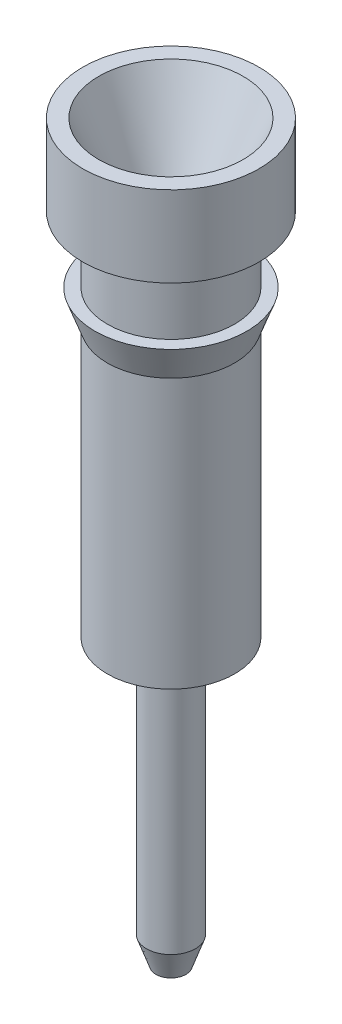
ISO-10303-21;
HEADER;
FILE_DESCRIPTION(('STEP AP214'),'2;1');
FILE_NAME('part.step','',(''),(''),'','','');
FILE_SCHEMA(('AUTOMOTIVE_DESIGN { 1 0 10303 214 1 1 1 1 }'));
ENDSEC;
DATA;
#1=APPLICATION_CONTEXT('core data for automotive mechanical design processes');
#2=APPLICATION_PROTOCOL_DEFINITION('international standard','automotive_design',2000,#1);
#3=PRODUCT_CONTEXT('',#1,'mechanical');
#4=PRODUCT('Part','Part','',(#3));
#5=PRODUCT_RELATED_PRODUCT_CATEGORY('part','',(#4));
#6=PRODUCT_DEFINITION_FORMATION('','',#4);
#7=PRODUCT_DEFINITION_CONTEXT('part definition',#1,'design');
#8=PRODUCT_DEFINITION('design','',#6,#7);
#9=PRODUCT_DEFINITION_SHAPE('','',#8);
#10=(LENGTH_UNIT() NAMED_UNIT(*) SI_UNIT(.MILLI.,.METRE.));
#11=(NAMED_UNIT(*) PLANE_ANGLE_UNIT() SI_UNIT($,.RADIAN.));
#12=(NAMED_UNIT(*) SI_UNIT($,.STERADIAN.) SOLID_ANGLE_UNIT());
#13=UNCERTAINTY_MEASURE_WITH_UNIT(LENGTH_MEASURE(1.E-05),#10,'distance_accuracy_value','');
#14=(GEOMETRIC_REPRESENTATION_CONTEXT(3) GLOBAL_UNCERTAINTY_ASSIGNED_CONTEXT((#13)) GLOBAL_UNIT_ASSIGNED_CONTEXT((#10,
#11,#12)) REPRESENTATION_CONTEXT('',''));
#15=CARTESIAN_POINT('',(0.,0.,0.));
#16=DIRECTION('',(0.,0.,1.));
#17=DIRECTION('',(1.,0.,0.));
#18=AXIS2_PLACEMENT_3D('',#15,#16,#17);
#19=CARTESIAN_POINT('',(0.,-6.07059999992998,0.));
#20=DIRECTION('',(0.,1.,0.));
#21=DIRECTION('',(0.,0.,1.));
#22=AXIS2_PLACEMENT_3D('',#19,#20,#21);
#23=CONICAL_SURFACE('',#22,0.152400000047237,0.785398163210954);
#24=CARTESIAN_POINT('',(0.,-6.22300000003406,0.));
#25=VERTEX_POINT('',#24);
#26=VERTEX_LOOP('',#25);
#27=FACE_BOUND('',#26,.T.);
#28=CARTESIAN_POINT('',(0.,-6.0706,0.));
#29=DIRECTION('',(0.,1.,0.));
#30=DIRECTION('',(-1.,0.,0.));
#31=AXIS2_PLACEMENT_3D('',#28,#29,#30);
#32=CIRCLE('',#31,0.1524);
#33=CARTESIAN_POINT('',(-0.1524,-6.0706,0.));
#34=VERTEX_POINT('',#33);
#35=EDGE_CURVE('E33',#34,#34,#32,.T.);
#36=ORIENTED_EDGE('',*,*,#35,.T.);
#37=EDGE_LOOP('',(#36));
#38=FACE_BOUND('',#37,.T.);
#39=ADVANCED_FACE('F17',(#27,#38),#23,.F.);
#40=CARTESIAN_POINT('',(0.,-6.223,0.));
#41=DIRECTION('',(0.,1.,0.));
#42=DIRECTION('',(-1.,0.,0.));
#43=AXIS2_PLACEMENT_3D('',#40,#41,#42);
#44=CYLINDRICAL_SURFACE('',#43,0.1524);
#45=CARTESIAN_POINT('',(0.,-4.77519999998322,0.));
#46=DIRECTION('',(0.,1.,0.));
#47=DIRECTION('',(-1.,0.,0.));
#48=AXIS2_PLACEMENT_3D('',#45,#46,#47);
#49=CIRCLE('',#48,0.152400000004604);
#50=CARTESIAN_POINT('',(-0.152400000004604,-4.77519999998322,0.));
#51=VERTEX_POINT('',#50);
#52=EDGE_CURVE('E35',#51,#51,#49,.T.);
#53=ORIENTED_EDGE('',*,*,#52,.T.);
#54=EDGE_LOOP('',(#53));
#55=FACE_BOUND('',#54,.T.);
#56=ORIENTED_EDGE('',*,*,#35,.F.);
#57=EDGE_LOOP('',(#56));
#58=FACE_BOUND('',#57,.T.);
#59=ADVANCED_FACE('F30',(#55,#58),#44,.F.);
#60=CARTESIAN_POINT('',(0.,-1.37769600013371,0.));
#61=DIRECTION('',(0.,1.,0.));
#62=DIRECTION('',(0.,0.,1.));
#63=AXIS2_PLACEMENT_3D('',#60,#61,#62);
#64=CONICAL_SURFACE('',#63,0.375919999996199,0.0656948015527935);
#65=CARTESIAN_POINT('',(0.,-1.377696,0.));
#66=DIRECTION('',(0.,1.,0.));
#67=DIRECTION('',(-1.,0.,0.));
#68=AXIS2_PLACEMENT_3D('',#65,#66,#67);
#69=CIRCLE('',#68,0.37592);
#70=CARTESIAN_POINT('',(-0.37592,-1.377696,0.));
#71=VERTEX_POINT('',#70);
#72=EDGE_CURVE('E38',#71,#71,#69,.T.);
#73=ORIENTED_EDGE('',*,*,#72,.T.);
#74=EDGE_LOOP('',(#73));
#75=FACE_BOUND('',#74,.T.);
#76=ORIENTED_EDGE('',*,*,#52,.F.);
#77=EDGE_LOOP('',(#76));
#78=FACE_BOUND('',#77,.T.);
#79=ADVANCED_FACE('F245',(#75,#78),#64,.F.);
#80=CARTESIAN_POINT('',(0.,-6.223,0.));
#81=DIRECTION('',(0.,1.,0.));
#82=DIRECTION('',(-1.,0.,0.));
#83=AXIS2_PLACEMENT_3D('',#80,#81,#82);
#84=CYLINDRICAL_SURFACE('',#83,0.37592);
#85=CARTESIAN_POINT('',(0.,-0.711200000012013,0.));
#86=DIRECTION('',(0.,1.,0.));
#87=DIRECTION('',(-1.,0.,0.));
#88=AXIS2_PLACEMENT_3D('',#85,#86,#87);
#89=CIRCLE('',#88,0.375919999981988);
#90=CARTESIAN_POINT('',(-0.375919999981988,-0.711200000012013,0.));
#91=VERTEX_POINT('',#90);
#92=EDGE_CURVE('E66',#91,#91,#89,.T.);
#93=ORIENTED_EDGE('',*,*,#92,.T.);
#94=EDGE_LOOP('',(#93));
#95=FACE_BOUND('',#94,.T.);
#96=ORIENTED_EDGE('',*,*,#72,.F.);
#97=EDGE_LOOP('',(#96));
#98=FACE_BOUND('',#97,.T.);
#99=ADVANCED_FACE('F206',(#95,#98),#84,.F.);
#100=CARTESIAN_POINT('',(0.,0.127000000020416,0.));
#101=DIRECTION('',(0.,1.,0.));
#102=DIRECTION('',(0.,0.,1.));
#103=AXIS2_PLACEMENT_3D('',#100,#101,#102);
#104=CONICAL_SURFACE('',#103,0.749299999995401,0.419067499698792);
#105=CARTESIAN_POINT('',(0.,0.127000000020416,0.));
#106=DIRECTION('',(0.,1.,0.));
#107=DIRECTION('',(0.,0.,1.));
#108=AXIS2_PLACEMENT_3D('',#105,#106,#107);
#109=CIRCLE('',#108,0.749299999995401);
#110=CARTESIAN_POINT('',(0.,0.127000000020416,0.749299999995401));
#111=VERTEX_POINT('',#110);
#112=EDGE_CURVE('E20',#111,#111,#109,.T.);
#113=ORIENTED_EDGE('',*,*,#112,.T.);
#114=EDGE_LOOP('',(#113));
#115=FACE_BOUND('',#114,.T.);
#116=ORIENTED_EDGE('',*,*,#92,.F.);
#117=EDGE_LOOP('',(#116));
#118=FACE_BOUND('',#117,.T.);
#119=ADVANCED_FACE('F202',(#115,#118),#104,.F.);
#120=CARTESIAN_POINT('',(0.,0.127,0.));
#121=DIRECTION('',(0.,-1.,0.));
#122=DIRECTION('',(0.,0.,-1.));
#123=AXIS2_PLACEMENT_3D('',#120,#121,#122);
#124=PLANE('',#123);
#125=ORIENTED_EDGE('',*,*,#112,.F.);
#126=EDGE_LOOP('',(#125));
#127=FACE_BOUND('',#126,.T.);
#128=CARTESIAN_POINT('',(0.,0.127,0.));
#129=DIRECTION('',(0.,1.,0.));
#130=DIRECTION('',(0.,0.,1.));
#131=AXIS2_PLACEMENT_3D('',#128,#129,#130);
#132=CIRCLE('',#131,0.9144);
#133=CARTESIAN_POINT('',(0.,0.127,0.9144));
#134=VERTEX_POINT('',#133);
#135=EDGE_CURVE('E61',#134,#134,#132,.F.);
#136=ORIENTED_EDGE('',*,*,#135,.F.);
#137=EDGE_LOOP('',(#136));
#138=FACE_BOUND('',#137,.T.);
#139=ADVANCED_FACE('F130',(#127,#138),#124,.F.);
#140=CARTESIAN_POINT('',(0.,-7.493,0.));
#141=DIRECTION('',(0.,1.,0.));
#142=DIRECTION('',(0.,0.,1.));
#143=AXIS2_PLACEMENT_3D('',#140,#141,#142);
#144=CYLINDRICAL_SURFACE('',#143,0.9144);
#145=ORIENTED_EDGE('',*,*,#135,.T.);
#146=EDGE_LOOP('',(#145));
#147=FACE_BOUND('',#146,.T.);
#148=CARTESIAN_POINT('',(0.,-0.711199999999998,0.));
#149=DIRECTION('',(0.,1.,0.));
#150=DIRECTION('',(0.,0.,1.));
#151=AXIS2_PLACEMENT_3D('',#148,#149,#150);
#152=CIRCLE('',#151,0.9144);
#153=CARTESIAN_POINT('',(0.,-0.711199999999998,0.9144));
#154=VERTEX_POINT('',#153);
#155=EDGE_CURVE('E59',#154,#154,#152,.T.);
#156=ORIENTED_EDGE('',*,*,#155,.T.);
#157=EDGE_LOOP('',(#156));
#158=FACE_BOUND('',#157,.T.);
#159=ADVANCED_FACE('F121',(#147,#158),#144,.T.);
#160=CARTESIAN_POINT('',(0.15621,-7.493,0.));
#161=DIRECTION('',(0.,1.,0.));
#162=DIRECTION('',(0.,0.,1.));
#163=AXIS2_PLACEMENT_3D('',#160,#161,#162);
#164=PLANE('',#163);
#165=CARTESIAN_POINT('',(0.,-7.49300000001085,0.));
#166=DIRECTION('',(0.,1.,0.));
#167=DIRECTION('',(0.,0.,1.));
#168=AXIS2_PLACEMENT_3D('',#165,#166,#167);
#169=CIRCLE('',#168,0.15621000001147);
#170=CARTESIAN_POINT('',(0.,-7.49300000001085,0.15621000001147));
#171=VERTEX_POINT('',#170);
#172=EDGE_CURVE('E56',#171,#171,#169,.T.);
#173=ORIENTED_EDGE('',*,*,#172,.F.);
#174=EDGE_LOOP('',(#173));
#175=FACE_BOUND('',#174,.T.);
#176=ADVANCED_FACE('F119',(#175),#164,.F.);
#177=CARTESIAN_POINT('',(0.9144,-0.7112,0.));
#178=DIRECTION('',(0.,1.,0.));
#179=DIRECTION('',(0.,0.,1.));
#180=AXIS2_PLACEMENT_3D('',#177,#178,#179);
#181=PLANE('',#180);
#182=ORIENTED_EDGE('',*,*,#155,.F.);
#183=EDGE_LOOP('',(#182));
#184=FACE_BOUND('',#183,.T.);
#185=CARTESIAN_POINT('',(0.,-0.7112,0.));
#186=DIRECTION('',(0.,1.,0.));
#187=DIRECTION('',(0.,0.,1.));
#188=AXIS2_PLACEMENT_3D('',#185,#186,#187);
#189=CIRCLE('',#188,0.6604);
#190=CARTESIAN_POINT('',(0.,-0.7112,0.6604));
#191=VERTEX_POINT('',#190);
#192=EDGE_CURVE('E53',#191,#191,#189,.F.);
#193=ORIENTED_EDGE('',*,*,#192,.F.);
#194=EDGE_LOOP('',(#193));
#195=FACE_BOUND('',#194,.T.);
#196=ADVANCED_FACE('F115',(#184,#195),#181,.F.);
#197=CARTESIAN_POINT('',(0.,-7.21360000011373,0.));
#198=DIRECTION('',(0.,1.,0.));
#199=DIRECTION('',(0.,0.,1.));
#200=AXIS2_PLACEMENT_3D('',#197,#198,#199);
#201=CONICAL_SURFACE('',#200,0.253999999983989,0.336674819413914);
#202=CARTESIAN_POINT('',(0.,-7.2136,0.));
#203=DIRECTION('',(0.,1.,0.));
#204=DIRECTION('',(0.,0.,1.));
#205=AXIS2_PLACEMENT_3D('',#202,#203,#204);
#206=CIRCLE('',#205,0.254);
#207=CARTESIAN_POINT('',(0.,-7.2136,0.254));
#208=VERTEX_POINT('',#207);
#209=EDGE_CURVE('E52',#208,#208,#206,.T.);
#210=ORIENTED_EDGE('',*,*,#209,.F.);
#211=EDGE_LOOP('',(#210));
#212=FACE_BOUND('',#211,.T.);
#213=ORIENTED_EDGE('',*,*,#172,.T.);
#214=EDGE_LOOP('',(#213));
#215=FACE_BOUND('',#214,.T.);
#216=ADVANCED_FACE('F112',(#212,#215),#201,.T.);
#217=CARTESIAN_POINT('',(0.,-7.493,0.));
#218=DIRECTION('',(0.,1.,0.));
#219=DIRECTION('',(0.,0.,1.));
#220=AXIS2_PLACEMENT_3D('',#217,#218,#219);
#221=CYLINDRICAL_SURFACE('',#220,0.6604);
#222=ORIENTED_EDGE('',*,*,#192,.T.);
#223=EDGE_LOOP('',(#222));
#224=FACE_BOUND('',#223,.T.);
#225=CARTESIAN_POINT('',(0.,-1.397,0.));
#226=DIRECTION('',(0.,1.,0.));
#227=DIRECTION('',(0.,0.,1.));
#228=AXIS2_PLACEMENT_3D('',#225,#226,#227);
#229=CIRCLE('',#228,0.6604);
#230=CARTESIAN_POINT('',(0.,-1.397,0.6604));
#231=VERTEX_POINT('',#230);
#232=EDGE_CURVE('E49',#231,#231,#229,.T.);
#233=ORIENTED_EDGE('',*,*,#232,.T.);
#234=EDGE_LOOP('',(#233));
#235=FACE_BOUND('',#234,.T.);
#236=ADVANCED_FACE('F108',(#224,#235),#221,.T.);
#237=CARTESIAN_POINT('',(0.,-7.493,0.));
#238=DIRECTION('',(0.,1.,0.));
#239=DIRECTION('',(0.,0.,1.));
#240=AXIS2_PLACEMENT_3D('',#237,#238,#239);
#241=CYLINDRICAL_SURFACE('',#240,0.254);
#242=CARTESIAN_POINT('',(0.,-4.77519999998322,0.));
#243=DIRECTION('',(0.,1.,0.));
#244=DIRECTION('',(0.,0.,1.));
#245=AXIS2_PLACEMENT_3D('',#242,#243,#244);
#246=CIRCLE('',#245,0.254000000040833);
#247=CARTESIAN_POINT('',(0.,-4.77519999998322,0.254000000040833));
#248=VERTEX_POINT('',#247);
#249=EDGE_CURVE('E48',#248,#248,#246,.T.);
#250=ORIENTED_EDGE('',*,*,#249,.F.);
#251=EDGE_LOOP('',(#250));
#252=FACE_BOUND('',#251,.T.);
#253=ORIENTED_EDGE('',*,*,#209,.T.);
#254=EDGE_LOOP('',(#253));
#255=FACE_BOUND('',#254,.T.);
#256=ADVANCED_FACE('F105',(#252,#255),#241,.T.);
#257=CARTESIAN_POINT('',(0.6604,-1.397,0.));
#258=DIRECTION('',(0.,-1.,0.));
#259=DIRECTION('',(0.,0.,-1.));
#260=AXIS2_PLACEMENT_3D('',#257,#258,#259);
#261=PLANE('',#260);
#262=ORIENTED_EDGE('',*,*,#232,.F.);
#263=EDGE_LOOP('',(#262));
#264=FACE_BOUND('',#263,.T.);
#265=CARTESIAN_POINT('',(0.,-1.39700000005405,0.));
#266=DIRECTION('',(0.,1.,0.));
#267=DIRECTION('',(0.,0.,1.));
#268=AXIS2_PLACEMENT_3D('',#265,#266,#267);
#269=CIRCLE('',#268,0.787400000020167);
#270=CARTESIAN_POINT('',(0.,-1.39700000005405,0.787400000020167));
#271=VERTEX_POINT('',#270);
#272=EDGE_CURVE('E45',#271,#271,#269,.F.);
#273=ORIENTED_EDGE('',*,*,#272,.F.);
#274=EDGE_LOOP('',(#273));
#275=FACE_BOUND('',#274,.T.);
#276=ADVANCED_FACE('F101',(#264,#275),#261,.F.);
#277=CARTESIAN_POINT('',(0.,-4.54056485062893,0.));
#278=DIRECTION('',(0.,1.,0.));
#279=DIRECTION('',(0.,0.,1.));
#280=AXIS2_PLACEMENT_3D('',#277,#278,#279);
#281=CONICAL_SURFACE('',#280,0.660399999958372,1.04719755119063);
#282=CARTESIAN_POINT('',(0.,-4.54056485060134,0.));
#283=DIRECTION('',(0.,1.,0.));
#284=DIRECTION('',(0.,0.,1.));
#285=AXIS2_PLACEMENT_3D('',#282,#283,#284);
#286=CIRCLE('',#285,0.6604);
#287=CARTESIAN_POINT('',(0.,-4.54056485060134,0.6604));
#288=VERTEX_POINT('',#287);
#289=EDGE_CURVE('E24',#288,#288,#286,.T.);
#290=ORIENTED_EDGE('',*,*,#289,.F.);
#291=EDGE_LOOP('',(#290));
#292=FACE_BOUND('',#291,.T.);
#293=ORIENTED_EDGE('',*,*,#249,.T.);
#294=EDGE_LOOP('',(#293));
#295=FACE_BOUND('',#294,.T.);
#296=ADVANCED_FACE('F97',(#292,#295),#281,.T.);
#297=CARTESIAN_POINT('',(0.,-1.39700000016774,0.));
#298=DIRECTION('',(0.,1.,0.));
#299=DIRECTION('',(0.,0.,1.));
#300=AXIS2_PLACEMENT_3D('',#297,#298,#299);
#301=CONICAL_SURFACE('',#300,0.787399999978788,0.349065850447534);
#302=ORIENTED_EDGE('',*,*,#272,.T.);
#303=EDGE_LOOP('',(#302));
#304=FACE_BOUND('',#303,.T.);
#305=CARTESIAN_POINT('',(0.,-1.74592963227074,0.));
#306=DIRECTION('',(0.,1.,0.));
#307=DIRECTION('',(0.,0.,1.));
#308=AXIS2_PLACEMENT_3D('',#305,#306,#307);
#309=CIRCLE('',#308,0.6604);
#310=CARTESIAN_POINT('',(0.,-1.74592963227074,0.6604));
#311=VERTEX_POINT('',#310);
#312=EDGE_CURVE('E11',#311,#311,#309,.F.);
#313=ORIENTED_EDGE('',*,*,#312,.F.);
#314=EDGE_LOOP('',(#313));
#315=FACE_BOUND('',#314,.T.);
#316=ADVANCED_FACE('F100',(#304,#315),#301,.T.);
#317=CARTESIAN_POINT('',(0.,-7.493,0.));
#318=DIRECTION('',(0.,1.,0.));
#319=DIRECTION('',(0.,0.,1.));
#320=AXIS2_PLACEMENT_3D('',#317,#318,#319);
#321=CYLINDRICAL_SURFACE('',#320,0.6604);
#322=ORIENTED_EDGE('',*,*,#312,.T.);
#323=EDGE_LOOP('',(#322));
#324=FACE_BOUND('',#323,.T.);
#325=ORIENTED_EDGE('',*,*,#289,.T.);
#326=EDGE_LOOP('',(#325));
#327=FACE_BOUND('',#326,.T.);
#328=ADVANCED_FACE('F95',(#324,#327),#321,.T.);
#329=CLOSED_SHELL('',(#39,#59,#79,#99,#119,#139,#159,#176,#196,#216,#236,#256,#276,#296,#316,#328));
#330=MANIFOLD_SOLID_BREP('B1',#329);
#331=ADVANCED_BREP_SHAPE_REPRESENTATION('',(#18,#330),#14);
#332=SHAPE_DEFINITION_REPRESENTATION(#9,#331);
ENDSEC;
END-ISO-10303-21;
